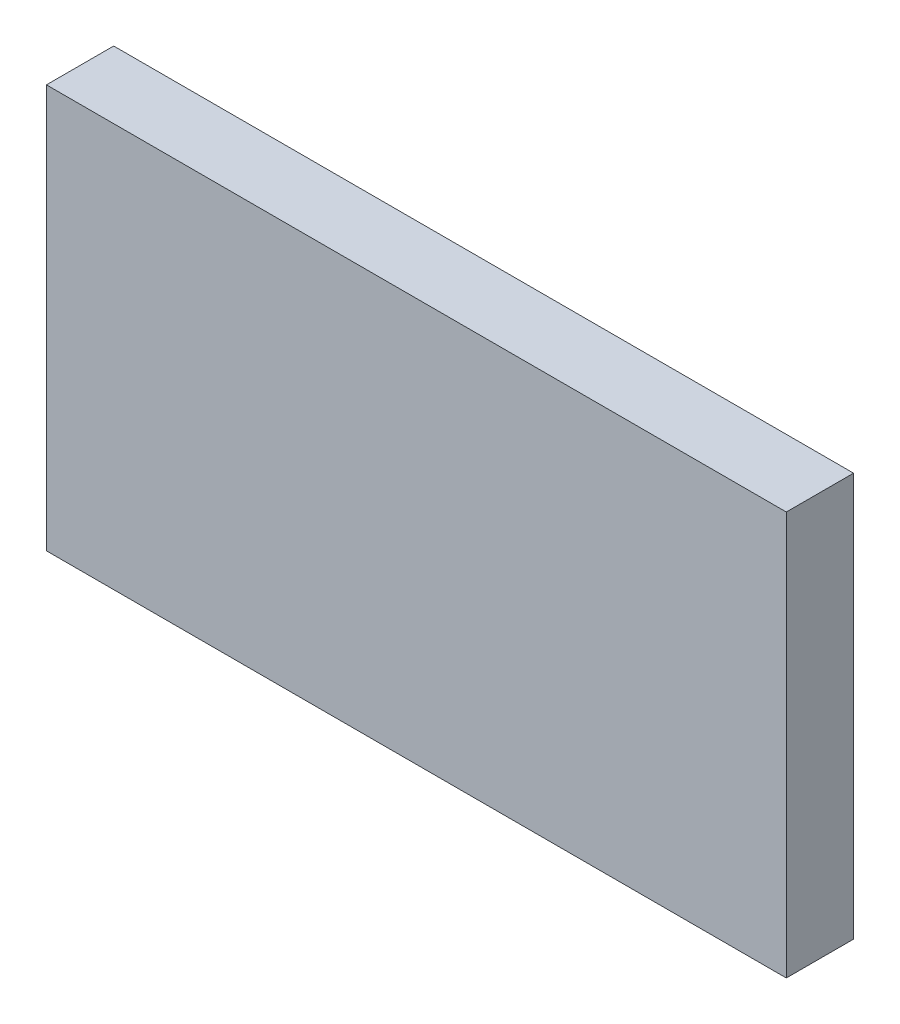
ISO-10303-21;
HEADER;
FILE_DESCRIPTION(('STEP AP214'),'2;1');
FILE_NAME('part.step','',(''),(''),'','','');
FILE_SCHEMA(('AUTOMOTIVE_DESIGN { 1 0 10303 214 1 1 1 1 }'));
ENDSEC;
DATA;
#1=APPLICATION_CONTEXT('core data for automotive mechanical design processes');
#2=APPLICATION_PROTOCOL_DEFINITION('international standard','automotive_design',2000,#1);
#3=PRODUCT_CONTEXT('',#1,'mechanical');
#4=PRODUCT('Part','Part','',(#3));
#5=PRODUCT_RELATED_PRODUCT_CATEGORY('part','',(#4));
#6=PRODUCT_DEFINITION_FORMATION('','',#4);
#7=PRODUCT_DEFINITION_CONTEXT('part definition',#1,'design');
#8=PRODUCT_DEFINITION('design','',#6,#7);
#9=PRODUCT_DEFINITION_SHAPE('','',#8);
#10=(LENGTH_UNIT() NAMED_UNIT(*) SI_UNIT(.MILLI.,.METRE.));
#11=(NAMED_UNIT(*) PLANE_ANGLE_UNIT() SI_UNIT($,.RADIAN.));
#12=(NAMED_UNIT(*) SI_UNIT($,.STERADIAN.) SOLID_ANGLE_UNIT());
#13=UNCERTAINTY_MEASURE_WITH_UNIT(LENGTH_MEASURE(1.E-05),#10,'distance_accuracy_value','');
#14=(GEOMETRIC_REPRESENTATION_CONTEXT(3) GLOBAL_UNCERTAINTY_ASSIGNED_CONTEXT((#13)) GLOBAL_UNIT_ASSIGNED_CONTEXT((#10,
#11,#12)) REPRESENTATION_CONTEXT('',''));
#15=CARTESIAN_POINT('',(0.,0.,0.));
#16=DIRECTION('',(0.,0.,1.));
#17=DIRECTION('',(1.,0.,0.));
#18=AXIS2_PLACEMENT_3D('',#15,#16,#17);
#19=CARTESIAN_POINT('',(0.,0.,3.));
#20=DIRECTION('',(1.,0.,0.));
#21=DIRECTION('',(0.,0.,-1.));
#22=AXIS2_PLACEMENT_3D('',#19,#20,#21);
#23=PLANE('',#22);
#24=DIRECTION('',(0.,-1.,0.));
#25=VECTOR('',#24,1.);
#26=CARTESIAN_POINT('',(0.,0.,0.));
#27=LINE('',#26,#25);
#28=CARTESIAN_POINT('',(0.,18.,0.));
#29=VERTEX_POINT('',#28);
#30=CARTESIAN_POINT('',(0.,0.,0.));
#31=VERTEX_POINT('',#30);
#32=EDGE_CURVE('E95',#29,#31,#27,.T.);
#33=ORIENTED_EDGE('',*,*,#32,.T.);
#34=DIRECTION('',(0.,0.,-1.));
#35=VECTOR('',#34,1.);
#36=CARTESIAN_POINT('',(0.,0.,3.));
#37=LINE('',#36,#35);
#38=CARTESIAN_POINT('',(0.,0.,3.));
#39=VERTEX_POINT('',#38);
#40=EDGE_CURVE('E11',#39,#31,#37,.T.);
#41=ORIENTED_EDGE('',*,*,#40,.F.);
#42=DIRECTION('',(0.,-1.,0.));
#43=VECTOR('',#42,1.);
#44=CARTESIAN_POINT('',(0.,0.,3.));
#45=LINE('',#44,#43);
#46=CARTESIAN_POINT('',(0.,18.,3.));
#47=VERTEX_POINT('',#46);
#48=EDGE_CURVE('E83',#47,#39,#45,.T.);
#49=ORIENTED_EDGE('',*,*,#48,.F.);
#50=DIRECTION('',(0.,0.,-1.));
#51=VECTOR('',#50,1.);
#52=CARTESIAN_POINT('',(0.,18.,3.));
#53=LINE('',#52,#51);
#54=EDGE_CURVE('E91',#47,#29,#53,.T.);
#55=ORIENTED_EDGE('',*,*,#54,.T.);
#56=EDGE_LOOP('',(#33,#41,#49,#55));
#57=FACE_BOUND('',#56,.T.);
#58=ADVANCED_FACE('F32',(#57),#23,.F.);
#59=CARTESIAN_POINT('',(0.,0.,3.));
#60=DIRECTION('',(0.,1.,0.));
#61=DIRECTION('',(0.,0.,1.));
#62=AXIS2_PLACEMENT_3D('',#59,#60,#61);
#63=PLANE('',#62);
#64=DIRECTION('',(1.,0.,0.));
#65=VECTOR('',#64,1.);
#66=CARTESIAN_POINT('',(0.,0.,0.));
#67=LINE('',#66,#65);
#68=CARTESIAN_POINT('',(33.,0.,0.));
#69=VERTEX_POINT('',#68);
#70=EDGE_CURVE('E87',#31,#69,#67,.T.);
#71=ORIENTED_EDGE('',*,*,#70,.T.);
#72=DIRECTION('',(0.,0.,-1.));
#73=VECTOR('',#72,1.);
#74=CARTESIAN_POINT('',(33.,0.,3.));
#75=LINE('',#74,#73);
#76=CARTESIAN_POINT('',(33.,0.,3.));
#77=VERTEX_POINT('',#76);
#78=EDGE_CURVE('E40',#77,#69,#75,.T.);
#79=ORIENTED_EDGE('',*,*,#78,.F.);
#80=DIRECTION('',(1.,0.,0.));
#81=VECTOR('',#80,1.);
#82=CARTESIAN_POINT('',(0.,0.,3.));
#83=LINE('',#82,#81);
#84=EDGE_CURVE('E78',#39,#77,#83,.T.);
#85=ORIENTED_EDGE('',*,*,#84,.F.);
#86=ORIENTED_EDGE('',*,*,#40,.T.);
#87=EDGE_LOOP('',(#71,#79,#85,#86));
#88=FACE_BOUND('',#87,.T.);
#89=ADVANCED_FACE('F86',(#88),#63,.F.);
#90=CARTESIAN_POINT('',(33.,0.,3.));
#91=DIRECTION('',(-1.,0.,0.));
#92=DIRECTION('',(0.,0.,1.));
#93=AXIS2_PLACEMENT_3D('',#90,#91,#92);
#94=PLANE('',#93);
#95=DIRECTION('',(0.,1.,0.));
#96=VECTOR('',#95,1.);
#97=CARTESIAN_POINT('',(33.,0.,0.));
#98=LINE('',#97,#96);
#99=CARTESIAN_POINT('',(33.,18.,0.));
#100=VERTEX_POINT('',#99);
#101=EDGE_CURVE('E65',#69,#100,#98,.T.);
#102=ORIENTED_EDGE('',*,*,#101,.T.);
#103=DIRECTION('',(0.,0.,-1.));
#104=VECTOR('',#103,1.);
#105=CARTESIAN_POINT('',(33.,18.,3.));
#106=LINE('',#105,#104);
#107=CARTESIAN_POINT('',(33.,18.,3.));
#108=VERTEX_POINT('',#107);
#109=EDGE_CURVE('E88',#108,#100,#106,.T.);
#110=ORIENTED_EDGE('',*,*,#109,.F.);
#111=DIRECTION('',(0.,1.,0.));
#112=VECTOR('',#111,1.);
#113=CARTESIAN_POINT('',(33.,0.,3.));
#114=LINE('',#113,#112);
#115=EDGE_CURVE('E81',#77,#108,#114,.T.);
#116=ORIENTED_EDGE('',*,*,#115,.F.);
#117=ORIENTED_EDGE('',*,*,#78,.T.);
#118=EDGE_LOOP('',(#102,#110,#116,#117));
#119=FACE_BOUND('',#118,.T.);
#120=ADVANCED_FACE('F89',(#119),#94,.F.);
#121=CARTESIAN_POINT('',(0.,18.,3.));
#122=DIRECTION('',(0.,-1.,0.));
#123=DIRECTION('',(0.,0.,-1.));
#124=AXIS2_PLACEMENT_3D('',#121,#122,#123);
#125=PLANE('',#124);
#126=DIRECTION('',(-1.,0.,0.));
#127=VECTOR('',#126,1.);
#128=CARTESIAN_POINT('',(0.,18.,0.));
#129=LINE('',#128,#127);
#130=EDGE_CURVE('E71',#100,#29,#129,.T.);
#131=ORIENTED_EDGE('',*,*,#130,.T.);
#132=ORIENTED_EDGE('',*,*,#54,.F.);
#133=DIRECTION('',(-1.,0.,0.));
#134=VECTOR('',#133,1.);
#135=CARTESIAN_POINT('',(0.,18.,3.));
#136=LINE('',#135,#134);
#137=EDGE_CURVE('E48',#108,#47,#136,.T.);
#138=ORIENTED_EDGE('',*,*,#137,.F.);
#139=ORIENTED_EDGE('',*,*,#109,.T.);
#140=EDGE_LOOP('',(#131,#132,#138,#139));
#141=FACE_BOUND('',#140,.T.);
#142=ADVANCED_FACE('F102',(#141),#125,.F.);
#143=CARTESIAN_POINT('',(0.,0.,3.));
#144=DIRECTION('',(0.,0.,-1.));
#145=DIRECTION('',(-1.,0.,0.));
#146=AXIS2_PLACEMENT_3D('',#143,#144,#145);
#147=PLANE('',#146);
#148=ORIENTED_EDGE('',*,*,#48,.T.);
#149=ORIENTED_EDGE('',*,*,#84,.T.);
#150=ORIENTED_EDGE('',*,*,#115,.T.);
#151=ORIENTED_EDGE('',*,*,#137,.T.);
#152=EDGE_LOOP('',(#148,#149,#150,#151));
#153=FACE_BOUND('',#152,.T.);
#154=ADVANCED_FACE('F79',(#153),#147,.F.);
#155=CARTESIAN_POINT('',(0.,0.,0.));
#156=DIRECTION('',(0.,0.,-1.));
#157=DIRECTION('',(-1.,0.,0.));
#158=AXIS2_PLACEMENT_3D('',#155,#156,#157);
#159=PLANE('',#158);
#160=ORIENTED_EDGE('',*,*,#32,.F.);
#161=ORIENTED_EDGE('',*,*,#130,.F.);
#162=ORIENTED_EDGE('',*,*,#101,.F.);
#163=ORIENTED_EDGE('',*,*,#70,.F.);
#164=EDGE_LOOP('',(#160,#161,#162,#163));
#165=FACE_BOUND('',#164,.T.);
#166=ADVANCED_FACE('F105',(#165),#159,.T.);
#167=CLOSED_SHELL('',(#58,#89,#120,#142,#154,#166));
#168=MANIFOLD_SOLID_BREP('B2',#167);
#169=ADVANCED_BREP_SHAPE_REPRESENTATION('',(#18,#168),#14);
#170=SHAPE_DEFINITION_REPRESENTATION(#9,#169);
ENDSEC;
END-ISO-10303-21;
